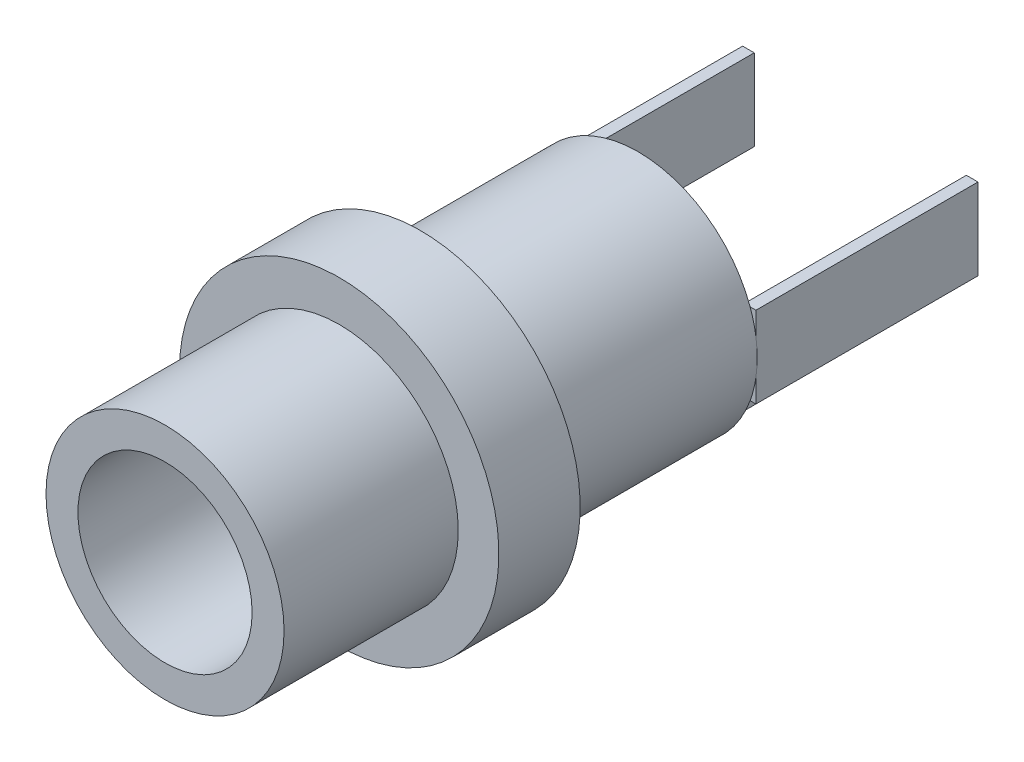
ISO-10303-21;
HEADER;
FILE_DESCRIPTION(('STEP AP214'),'2;1');
FILE_NAME('part.step','',(''),(''),'','','');
FILE_SCHEMA(('AUTOMOTIVE_DESIGN { 1 0 10303 214 1 1 1 1 }'));
ENDSEC;
DATA;
#1=APPLICATION_CONTEXT('core data for automotive mechanical design processes');
#2=APPLICATION_PROTOCOL_DEFINITION('international standard','automotive_design',2000,#1);
#3=PRODUCT_CONTEXT('',#1,'mechanical');
#4=PRODUCT('Part','Part','',(#3));
#5=PRODUCT_RELATED_PRODUCT_CATEGORY('part','',(#4));
#6=PRODUCT_DEFINITION_FORMATION('','',#4);
#7=PRODUCT_DEFINITION_CONTEXT('part definition',#1,'design');
#8=PRODUCT_DEFINITION('design','',#6,#7);
#9=PRODUCT_DEFINITION_SHAPE('','',#8);
#10=(LENGTH_UNIT() NAMED_UNIT(*) SI_UNIT(.MILLI.,.METRE.));
#11=(NAMED_UNIT(*) PLANE_ANGLE_UNIT() SI_UNIT($,.RADIAN.));
#12=(NAMED_UNIT(*) SI_UNIT($,.STERADIAN.) SOLID_ANGLE_UNIT());
#13=UNCERTAINTY_MEASURE_WITH_UNIT(LENGTH_MEASURE(1.E-05),#10,'distance_accuracy_value','');
#14=(GEOMETRIC_REPRESENTATION_CONTEXT(3) GLOBAL_UNCERTAINTY_ASSIGNED_CONTEXT((#13)) GLOBAL_UNIT_ASSIGNED_CONTEXT((#10,
#11,#12)) REPRESENTATION_CONTEXT('',''));
#15=CARTESIAN_POINT('',(0.,0.,0.));
#16=DIRECTION('',(0.,0.,1.));
#17=DIRECTION('',(1.,0.,0.));
#18=AXIS2_PLACEMENT_3D('',#15,#16,#17);
#19=CARTESIAN_POINT('',(0.,0.,-16.3));
#20=DIRECTION('',(0.,0.,-1.));
#21=DIRECTION('',(-1.,0.,0.));
#22=AXIS2_PLACEMENT_3D('',#19,#20,#21);
#23=PLANE('',#22);
#24=DIRECTION('',(0.,1.,0.));
#25=VECTOR('',#24,1.);
#26=CARTESIAN_POINT('',(-4.05356977359954,1.4,-16.3));
#27=LINE('',#26,#25);
#28=CARTESIAN_POINT('',(-4.05356977359954,0.615282122737358,-16.3));
#29=VERTEX_POINT('',#28);
#30=CARTESIAN_POINT('',(-4.05356977359954,-0.615282122737358,-16.3));
#31=VERTEX_POINT('',#30);
#32=EDGE_CURVE('E200',#29,#31,#27,.F.);
#33=ORIENTED_EDGE('',*,*,#32,.T.);
#34=CARTESIAN_POINT('',(0.,0.,-16.3));
#35=DIRECTION('',(0.,0.,-1.));
#36=DIRECTION('',(-1.,0.,0.));
#37=AXIS2_PLACEMENT_3D('',#34,#35,#36);
#38=CIRCLE('',#37,4.1);
#39=EDGE_CURVE('E617',#31,#29,#38,.T.);
#40=ORIENTED_EDGE('',*,*,#39,.T.);
#41=EDGE_LOOP('',(#33,#40));
#42=FACE_BOUND('',#41,.T.);
#43=ADVANCED_FACE('F34',(#42),#23,.T.);
#44=CARTESIAN_POINT('',(0.615282122737358,-4.05356977359954,-16.3));
#45=VERTEX_POINT('',#44);
#46=CARTESIAN_POINT('',(-0.615282122737358,-4.05356977359954,-16.3));
#47=VERTEX_POINT('',#46);
#48=EDGE_CURVE('E622',#45,#47,#38,.T.);
#49=ORIENTED_EDGE('',*,*,#48,.T.);
#50=DIRECTION('',(-1.,0.,0.));
#51=VECTOR('',#50,1.);
#52=CARTESIAN_POINT('',(1.4,-4.05356977359954,-16.3));
#53=LINE('',#52,#51);
#54=EDGE_CURVE('E224',#45,#47,#53,.T.);
#55=ORIENTED_EDGE('',*,*,#54,.F.);
#56=EDGE_LOOP('',(#49,#55));
#57=FACE_BOUND('',#56,.T.);
#58=ADVANCED_FACE('F321',(#57),#23,.T.);
#59=DIRECTION('',(1.,0.,0.));
#60=VECTOR('',#59,1.);
#61=CARTESIAN_POINT('',(-4.05356977359954,-1.4,-16.3));
#62=LINE('',#61,#60);
#63=CARTESIAN_POINT('',(-3.85356977359954,-1.4,-16.3));
#64=VERTEX_POINT('',#63);
#65=CARTESIAN_POINT('',(-3.65356977359954,-1.4,-16.3));
#66=VERTEX_POINT('',#65);
#67=EDGE_CURVE('E53',#64,#66,#62,.T.);
#68=ORIENTED_EDGE('',*,*,#67,.T.);
#69=DIRECTION('',(0.,1.,0.));
#70=VECTOR('',#69,1.);
#71=CARTESIAN_POINT('',(-3.65356977359954,1.4,-16.3));
#72=LINE('',#71,#70);
#73=CARTESIAN_POINT('',(-3.65356977359954,1.4,-16.3));
#74=VERTEX_POINT('',#73);
#75=EDGE_CURVE('E58',#74,#66,#72,.F.);
#76=ORIENTED_EDGE('',*,*,#75,.F.);
#77=DIRECTION('',(-1.,0.,0.));
#78=VECTOR('',#77,1.);
#79=CARTESIAN_POINT('',(-3.65356977359954,1.4,-16.3));
#80=LINE('',#79,#78);
#81=CARTESIAN_POINT('',(-3.85356977359954,1.4,-16.3));
#82=VERTEX_POINT('',#81);
#83=EDGE_CURVE('E174',#74,#82,#80,.T.);
#84=ORIENTED_EDGE('',*,*,#83,.T.);
#85=CARTESIAN_POINT('',(3.85356977359954,1.4,-16.3));
#86=VERTEX_POINT('',#85);
#87=EDGE_CURVE('E273',#82,#86,#38,.T.);
#88=ORIENTED_EDGE('',*,*,#87,.T.);
#89=DIRECTION('',(-1.,0.,0.));
#90=VECTOR('',#89,1.);
#91=CARTESIAN_POINT('',(4.05356977359954,1.4,-16.3));
#92=LINE('',#91,#90);
#93=CARTESIAN_POINT('',(3.65356977359954,1.4,-16.3));
#94=VERTEX_POINT('',#93);
#95=EDGE_CURVE('E43',#86,#94,#92,.T.);
#96=ORIENTED_EDGE('',*,*,#95,.T.);
#97=DIRECTION('',(0.,1.,0.));
#98=VECTOR('',#97,1.);
#99=CARTESIAN_POINT('',(3.65356977359954,1.4,-16.3));
#100=LINE('',#99,#98);
#101=CARTESIAN_POINT('',(3.65356977359954,-1.4,-16.3));
#102=VERTEX_POINT('',#101);
#103=EDGE_CURVE('E260',#94,#102,#100,.F.);
#104=ORIENTED_EDGE('',*,*,#103,.T.);
#105=DIRECTION('',(1.,0.,0.));
#106=VECTOR('',#105,1.);
#107=CARTESIAN_POINT('',(3.65356977359954,-1.4,-16.3));
#108=LINE('',#107,#106);
#109=CARTESIAN_POINT('',(3.85356977359954,-1.4,-16.3));
#110=VERTEX_POINT('',#109);
#111=EDGE_CURVE('E257',#102,#110,#108,.T.);
#112=ORIENTED_EDGE('',*,*,#111,.T.);
#113=CARTESIAN_POINT('',(1.4,-3.85356977359954,-16.3));
#114=VERTEX_POINT('',#113);
#115=EDGE_CURVE('E629',#110,#114,#38,.T.);
#116=ORIENTED_EDGE('',*,*,#115,.T.);
#117=DIRECTION('',(0.,1.,0.));
#118=VECTOR('',#117,1.);
#119=CARTESIAN_POINT('',(1.4,-4.05356977359954,-16.3));
#120=LINE('',#119,#118);
#121=CARTESIAN_POINT('',(1.4,-3.65356977359954,-16.3));
#122=VERTEX_POINT('',#121);
#123=EDGE_CURVE('E229',#114,#122,#120,.T.);
#124=ORIENTED_EDGE('',*,*,#123,.T.);
#125=DIRECTION('',(-1.,0.,0.));
#126=VECTOR('',#125,1.);
#127=CARTESIAN_POINT('',(1.4,-3.65356977359954,-16.3));
#128=LINE('',#127,#126);
#129=CARTESIAN_POINT('',(-1.4,-3.65356977359954,-16.3));
#130=VERTEX_POINT('',#129);
#131=EDGE_CURVE('E227',#122,#130,#128,.T.);
#132=ORIENTED_EDGE('',*,*,#131,.T.);
#133=DIRECTION('',(0.,-1.,0.));
#134=VECTOR('',#133,1.);
#135=CARTESIAN_POINT('',(-1.4,-3.65356977359954,-16.3));
#136=LINE('',#135,#134);
#137=CARTESIAN_POINT('',(-1.4,-3.85356977359954,-16.3));
#138=VERTEX_POINT('',#137);
#139=EDGE_CURVE('E225',#130,#138,#136,.T.);
#140=ORIENTED_EDGE('',*,*,#139,.T.);
#141=EDGE_CURVE('E618',#138,#64,#38,.T.);
#142=ORIENTED_EDGE('',*,*,#141,.T.);
#143=EDGE_LOOP('',(#68,#76,#84,#88,#96,#104,#112,#116,#124,#132,#140,#142));
#144=FACE_BOUND('',#143,.T.);
#145=ADVANCED_FACE('F328',(#144),#23,.T.);
#146=CARTESIAN_POINT('',(0.,0.,-6.));
#147=DIRECTION('',(0.,0.,1.));
#148=DIRECTION('',(1.,0.,0.));
#149=AXIS2_PLACEMENT_3D('',#146,#147,#148);
#150=CYLINDRICAL_SURFACE('',#149,4.1);
#151=CARTESIAN_POINT('',(0.,0.,-6.));
#152=DIRECTION('',(0.,0.,1.));
#153=DIRECTION('',(1.,0.,0.));
#154=AXIS2_PLACEMENT_3D('',#151,#152,#153);
#155=CIRCLE('',#154,4.1);
#156=CARTESIAN_POINT('',(4.1,0.,-6.));
#157=VERTEX_POINT('',#156);
#158=EDGE_CURVE('E284',#157,#157,#155,.T.);
#159=ORIENTED_EDGE('',*,*,#158,.T.);
#160=EDGE_LOOP('',(#159));
#161=FACE_BOUND('',#160,.T.);
#162=CARTESIAN_POINT('',(0.,0.,0.));
#163=DIRECTION('',(0.,0.,1.));
#164=DIRECTION('',(1.,0.,0.));
#165=AXIS2_PLACEMENT_3D('',#162,#163,#164);
#166=CIRCLE('',#165,4.1);
#167=CARTESIAN_POINT('',(4.1,0.,0.));
#168=VERTEX_POINT('',#167);
#169=EDGE_CURVE('E38',#168,#168,#166,.T.);
#170=ORIENTED_EDGE('',*,*,#169,.F.);
#171=EDGE_LOOP('',(#170));
#172=FACE_BOUND('',#171,.T.);
#173=ADVANCED_FACE('F36',(#161,#172),#150,.T.);
#174=CARTESIAN_POINT('',(0.,0.,0.));
#175=DIRECTION('',(0.,0.,1.));
#176=DIRECTION('',(1.,0.,0.));
#177=AXIS2_PLACEMENT_3D('',#174,#175,#176);
#178=PLANE('',#177);
#179=CARTESIAN_POINT('',(0.,0.,0.));
#180=DIRECTION('',(0.,0.,1.));
#181=DIRECTION('',(1.,0.,0.));
#182=AXIS2_PLACEMENT_3D('',#179,#180,#181);
#183=CIRCLE('',#182,3.);
#184=CARTESIAN_POINT('',(3.,0.,0.));
#185=VERTEX_POINT('',#184);
#186=EDGE_CURVE('E290',#185,#185,#183,.T.);
#187=ORIENTED_EDGE('',*,*,#186,.F.);
#188=EDGE_LOOP('',(#187));
#189=FACE_BOUND('',#188,.T.);
#190=ORIENTED_EDGE('',*,*,#169,.T.);
#191=EDGE_LOOP('',(#190));
#192=FACE_BOUND('',#191,.T.);
#193=ADVANCED_FACE('F349',(#189,#192),#178,.T.);
#194=CARTESIAN_POINT('',(0.,0.,-6.));
#195=DIRECTION('',(0.,0.,1.));
#196=DIRECTION('',(1.,0.,0.));
#197=AXIS2_PLACEMENT_3D('',#194,#195,#196);
#198=CYLINDRICAL_SURFACE('',#197,3.);
#199=CARTESIAN_POINT('',(0.,0.,-6.));
#200=DIRECTION('',(0.,0.,1.));
#201=DIRECTION('',(1.,0.,0.));
#202=AXIS2_PLACEMENT_3D('',#199,#200,#201);
#203=CIRCLE('',#202,3.);
#204=CARTESIAN_POINT('',(3.,0.,-6.));
#205=VERTEX_POINT('',#204);
#206=EDGE_CURVE('E287',#205,#205,#203,.T.);
#207=ORIENTED_EDGE('',*,*,#206,.F.);
#208=EDGE_LOOP('',(#207));
#209=FACE_BOUND('',#208,.T.);
#210=ORIENTED_EDGE('',*,*,#186,.T.);
#211=EDGE_LOOP('',(#210));
#212=FACE_BOUND('',#211,.T.);
#213=ADVANCED_FACE('F301',(#209,#212),#198,.F.);
#214=CARTESIAN_POINT('',(0.,0.,-6.));
#215=DIRECTION('',(0.,0.,-1.));
#216=DIRECTION('',(-1.,0.,0.));
#217=AXIS2_PLACEMENT_3D('',#214,#215,#216);
#218=PLANE('',#217);
#219=ORIENTED_EDGE('',*,*,#158,.F.);
#220=EDGE_LOOP('',(#219));
#221=FACE_BOUND('',#220,.T.);
#222=CARTESIAN_POINT('',(0.,0.,-6.));
#223=DIRECTION('',(0.,0.,-1.));
#224=DIRECTION('',(-1.,0.,0.));
#225=AXIS2_PLACEMENT_3D('',#222,#223,#224);
#226=CIRCLE('',#225,5.5);
#227=CARTESIAN_POINT('',(-5.5,0.,-6.));
#228=VERTEX_POINT('',#227);
#229=EDGE_CURVE('E276',#228,#228,#226,.T.);
#230=ORIENTED_EDGE('',*,*,#229,.F.);
#231=EDGE_LOOP('',(#230));
#232=FACE_BOUND('',#231,.T.);
#233=ADVANCED_FACE('F297',(#221,#232),#218,.F.);
#234=CARTESIAN_POINT('',(0.,0.,-8.8));
#235=DIRECTION('',(0.,0.,-1.));
#236=DIRECTION('',(-1.,0.,0.));
#237=AXIS2_PLACEMENT_3D('',#234,#235,#236);
#238=PLANE('',#237);
#239=CARTESIAN_POINT('',(0.,0.,-8.8));
#240=DIRECTION('',(0.,0.,-1.));
#241=DIRECTION('',(-1.,0.,0.));
#242=AXIS2_PLACEMENT_3D('',#239,#240,#241);
#243=CIRCLE('',#242,4.1);
#244=CARTESIAN_POINT('',(-4.1,0.,-8.8));
#245=VERTEX_POINT('',#244);
#246=EDGE_CURVE('E278',#245,#245,#243,.T.);
#247=ORIENTED_EDGE('',*,*,#246,.F.);
#248=EDGE_LOOP('',(#247));
#249=FACE_BOUND('',#248,.T.);
#250=CARTESIAN_POINT('',(0.,0.,-8.8));
#251=DIRECTION('',(0.,0.,-1.));
#252=DIRECTION('',(-1.,0.,0.));
#253=AXIS2_PLACEMENT_3D('',#250,#251,#252);
#254=CIRCLE('',#253,5.5);
#255=CARTESIAN_POINT('',(-5.5,0.,-8.8));
#256=VERTEX_POINT('',#255);
#257=EDGE_CURVE('E281',#256,#256,#254,.T.);
#258=ORIENTED_EDGE('',*,*,#257,.T.);
#259=EDGE_LOOP('',(#258));
#260=FACE_BOUND('',#259,.T.);
#261=ADVANCED_FACE('F300',(#249,#260),#238,.T.);
#262=CARTESIAN_POINT('',(0.,0.,-8.8));
#263=DIRECTION('',(0.,0.,1.));
#264=DIRECTION('',(1.,0.,0.));
#265=AXIS2_PLACEMENT_3D('',#262,#263,#264);
#266=CYLINDRICAL_SURFACE('',#265,5.5);
#267=ORIENTED_EDGE('',*,*,#257,.F.);
#268=EDGE_LOOP('',(#267));
#269=FACE_BOUND('',#268,.T.);
#270=ORIENTED_EDGE('',*,*,#229,.T.);
#271=EDGE_LOOP('',(#270));
#272=FACE_BOUND('',#271,.T.);
#273=ADVANCED_FACE('F306',(#269,#272),#266,.T.);
#274=ORIENTED_EDGE('',*,*,#206,.T.);
#275=EDGE_LOOP('',(#274));
#276=FACE_BOUND('',#275,.T.);
#277=ADVANCED_FACE('F303',(#276),#218,.F.);
#278=CARTESIAN_POINT('',(0.,0.,-16.3));
#279=DIRECTION('',(0.,0.,1.));
#280=DIRECTION('',(1.,0.,0.));
#281=AXIS2_PLACEMENT_3D('',#278,#279,#280);
#282=CYLINDRICAL_SURFACE('',#281,4.1);
#283=CARTESIAN_POINT('',(4.05356977359954,0.615282122737358,-16.3));
#284=VERTEX_POINT('',#283);
#285=EDGE_CURVE('E274',#86,#284,#38,.T.);
#286=ORIENTED_EDGE('',*,*,#285,.F.);
#287=ORIENTED_EDGE('',*,*,#87,.F.);
#288=EDGE_CURVE('E614',#29,#82,#38,.T.);
#289=ORIENTED_EDGE('',*,*,#288,.F.);
#290=ORIENTED_EDGE('',*,*,#39,.F.);
#291=EDGE_CURVE('E602',#64,#31,#38,.T.);
#292=ORIENTED_EDGE('',*,*,#291,.F.);
#293=ORIENTED_EDGE('',*,*,#141,.F.);
#294=EDGE_CURVE('E619',#47,#138,#38,.T.);
#295=ORIENTED_EDGE('',*,*,#294,.F.);
#296=ORIENTED_EDGE('',*,*,#48,.F.);
#297=EDGE_CURVE('E626',#114,#45,#38,.T.);
#298=ORIENTED_EDGE('',*,*,#297,.F.);
#299=ORIENTED_EDGE('',*,*,#115,.F.);
#300=CARTESIAN_POINT('',(4.05356977359954,-0.615282122737358,-16.3));
#301=VERTEX_POINT('',#300);
#302=EDGE_CURVE('E632',#301,#110,#38,.T.);
#303=ORIENTED_EDGE('',*,*,#302,.F.);
#304=EDGE_CURVE('E277',#284,#301,#38,.T.);
#305=ORIENTED_EDGE('',*,*,#304,.F.);
#306=EDGE_LOOP('',(#286,#287,#289,#290,#292,#293,#295,#296,#298,#299,#303,#305));
#307=FACE_BOUND('',#306,.T.);
#308=ORIENTED_EDGE('',*,*,#246,.T.);
#309=EDGE_LOOP('',(#308));
#310=FACE_BOUND('',#309,.T.);
#311=ADVANCED_FACE('F314',(#307,#310),#282,.T.);
#312=DIRECTION('',(0.,1.,0.));
#313=VECTOR('',#312,1.);
#314=CARTESIAN_POINT('',(4.05356977359954,1.4,-16.3));
#315=LINE('',#314,#313);
#316=EDGE_CURVE('E11',#284,#301,#315,.F.);
#317=ORIENTED_EDGE('',*,*,#316,.F.);
#318=ORIENTED_EDGE('',*,*,#304,.T.);
#319=EDGE_LOOP('',(#317,#318));
#320=FACE_BOUND('',#319,.T.);
#321=ADVANCED_FACE('F324',(#320),#23,.T.);
#322=CARTESIAN_POINT('',(0.,0.,-16.3));
#323=DIRECTION('',(0.,0.,-1.));
#324=DIRECTION('',(-1.,0.,0.));
#325=AXIS2_PLACEMENT_3D('',#322,#323,#324);
#326=PLANE('',#325);
#327=CARTESIAN_POINT('',(4.05356977359954,1.4,-16.3));
#328=VERTEX_POINT('',#327);
#329=EDGE_CURVE('E245',#328,#86,#92,.T.);
#330=ORIENTED_EDGE('',*,*,#329,.T.);
#331=ORIENTED_EDGE('',*,*,#285,.T.);
#332=EDGE_CURVE('E45',#328,#284,#315,.F.);
#333=ORIENTED_EDGE('',*,*,#332,.F.);
#334=EDGE_LOOP('',(#330,#331,#333));
#335=FACE_BOUND('',#334,.T.);
#336=ADVANCED_FACE('F334',(#335),#326,.F.);
#337=CARTESIAN_POINT('',(4.05356977359954,-1.4,-16.3));
#338=VERTEX_POINT('',#337);
#339=EDGE_CURVE('E46',#301,#338,#315,.F.);
#340=ORIENTED_EDGE('',*,*,#339,.F.);
#341=ORIENTED_EDGE('',*,*,#302,.T.);
#342=EDGE_CURVE('E256',#110,#338,#108,.T.);
#343=ORIENTED_EDGE('',*,*,#342,.T.);
#344=EDGE_LOOP('',(#340,#341,#343));
#345=FACE_BOUND('',#344,.T.);
#346=ADVANCED_FACE('F340',(#345),#326,.F.);
#347=CARTESIAN_POINT('',(4.05356977359954,1.4,-23.95));
#348=DIRECTION('',(-1.,0.,0.));
#349=DIRECTION('',(0.,0.,1.));
#350=AXIS2_PLACEMENT_3D('',#347,#348,#349);
#351=PLANE('',#350);
#352=ORIENTED_EDGE('',*,*,#332,.T.);
#353=ORIENTED_EDGE('',*,*,#316,.T.);
#354=ORIENTED_EDGE('',*,*,#339,.T.);
#355=DIRECTION('',(0.,0.,1.));
#356=VECTOR('',#355,1.);
#357=CARTESIAN_POINT('',(4.05356977359954,-1.4,-23.95));
#358=LINE('',#357,#356);
#359=CARTESIAN_POINT('',(4.05356977359954,-1.4,-23.95));
#360=VERTEX_POINT('',#359);
#361=EDGE_CURVE('E270',#360,#338,#358,.T.);
#362=ORIENTED_EDGE('',*,*,#361,.F.);
#363=DIRECTION('',(0.,1.,0.));
#364=VECTOR('',#363,1.);
#365=CARTESIAN_POINT('',(4.05356977359954,1.4,-23.95));
#366=LINE('',#365,#364);
#367=CARTESIAN_POINT('',(4.05356977359954,1.4,-23.95));
#368=VERTEX_POINT('',#367);
#369=EDGE_CURVE('E242',#368,#360,#366,.F.);
#370=ORIENTED_EDGE('',*,*,#369,.F.);
#371=DIRECTION('',(0.,0.,1.));
#372=VECTOR('',#371,1.);
#373=CARTESIAN_POINT('',(4.05356977359954,1.4,-23.95));
#374=LINE('',#373,#372);
#375=EDGE_CURVE('E253',#368,#328,#374,.T.);
#376=ORIENTED_EDGE('',*,*,#375,.T.);
#377=EDGE_LOOP('',(#352,#353,#354,#362,#370,#376));
#378=FACE_BOUND('',#377,.T.);
#379=ADVANCED_FACE('F417',(#378),#351,.F.);
#380=CARTESIAN_POINT('',(3.65356977359954,-1.4,-23.95));
#381=DIRECTION('',(0.,-1.,0.));
#382=DIRECTION('',(0.,0.,-1.));
#383=AXIS2_PLACEMENT_3D('',#380,#381,#382);
#384=PLANE('',#383);
#385=ORIENTED_EDGE('',*,*,#111,.F.);
#386=DIRECTION('',(0.,0.,1.));
#387=VECTOR('',#386,1.);
#388=CARTESIAN_POINT('',(3.65356977359954,-1.4,-23.95));
#389=LINE('',#388,#387);
#390=CARTESIAN_POINT('',(3.65356977359954,-1.4,-23.95));
#391=VERTEX_POINT('',#390);
#392=EDGE_CURVE('E268',#391,#102,#389,.T.);
#393=ORIENTED_EDGE('',*,*,#392,.F.);
#394=DIRECTION('',(1.,0.,0.));
#395=VECTOR('',#394,1.);
#396=CARTESIAN_POINT('',(3.65356977359954,-1.4,-23.95));
#397=LINE('',#396,#395);
#398=EDGE_CURVE('E244',#391,#360,#397,.T.);
#399=ORIENTED_EDGE('',*,*,#398,.T.);
#400=ORIENTED_EDGE('',*,*,#361,.T.);
#401=ORIENTED_EDGE('',*,*,#342,.F.);
#402=EDGE_LOOP('',(#385,#393,#399,#400,#401));
#403=FACE_BOUND('',#402,.T.);
#404=ADVANCED_FACE('F426',(#403),#384,.T.);
#405=CARTESIAN_POINT('',(3.65356977359954,1.4,-23.95));
#406=DIRECTION('',(-1.,0.,0.));
#407=DIRECTION('',(0.,0.,1.));
#408=AXIS2_PLACEMENT_3D('',#405,#406,#407);
#409=PLANE('',#408);
#410=ORIENTED_EDGE('',*,*,#103,.F.);
#411=DIRECTION('',(0.,0.,1.));
#412=VECTOR('',#411,1.);
#413=CARTESIAN_POINT('',(3.65356977359954,1.4,-23.95));
#414=LINE('',#413,#412);
#415=CARTESIAN_POINT('',(3.65356977359954,1.4,-23.95));
#416=VERTEX_POINT('',#415);
#417=EDGE_CURVE('E266',#416,#94,#414,.T.);
#418=ORIENTED_EDGE('',*,*,#417,.F.);
#419=DIRECTION('',(0.,1.,0.));
#420=VECTOR('',#419,1.);
#421=CARTESIAN_POINT('',(3.65356977359954,1.4,-23.95));
#422=LINE('',#421,#420);
#423=EDGE_CURVE('E248',#416,#391,#422,.F.);
#424=ORIENTED_EDGE('',*,*,#423,.T.);
#425=ORIENTED_EDGE('',*,*,#392,.T.);
#426=EDGE_LOOP('',(#410,#418,#424,#425));
#427=FACE_BOUND('',#426,.T.);
#428=ADVANCED_FACE('F435',(#427),#409,.T.);
#429=CARTESIAN_POINT('',(4.05356977359954,1.4,-23.95));
#430=DIRECTION('',(0.,1.,0.));
#431=DIRECTION('',(0.,0.,1.));
#432=AXIS2_PLACEMENT_3D('',#429,#430,#431);
#433=PLANE('',#432);
#434=ORIENTED_EDGE('',*,*,#329,.F.);
#435=ORIENTED_EDGE('',*,*,#375,.F.);
#436=DIRECTION('',(-1.,0.,0.));
#437=VECTOR('',#436,1.);
#438=CARTESIAN_POINT('',(4.05356977359954,1.4,-23.95));
#439=LINE('',#438,#437);
#440=EDGE_CURVE('E251',#368,#416,#439,.T.);
#441=ORIENTED_EDGE('',*,*,#440,.T.);
#442=ORIENTED_EDGE('',*,*,#417,.T.);
#443=ORIENTED_EDGE('',*,*,#95,.F.);
#444=EDGE_LOOP('',(#434,#435,#441,#442,#443));
#445=FACE_BOUND('',#444,.T.);
#446=ADVANCED_FACE('F445',(#445),#433,.T.);
#447=CARTESIAN_POINT('',(0.,0.,-23.95));
#448=DIRECTION('',(0.,0.,-1.));
#449=DIRECTION('',(-1.,0.,0.));
#450=AXIS2_PLACEMENT_3D('',#447,#448,#449);
#451=PLANE('',#450);
#452=ORIENTED_EDGE('',*,*,#369,.T.);
#453=ORIENTED_EDGE('',*,*,#398,.F.);
#454=ORIENTED_EDGE('',*,*,#423,.F.);
#455=ORIENTED_EDGE('',*,*,#440,.F.);
#456=EDGE_LOOP('',(#452,#453,#454,#455));
#457=FACE_BOUND('',#456,.T.);
#458=ADVANCED_FACE('F455',(#457),#451,.T.);
#459=CARTESIAN_POINT('',(0.,0.,-16.3));
#460=DIRECTION('',(0.,0.,1.));
#461=DIRECTION('',(1.,0.,0.));
#462=AXIS2_PLACEMENT_3D('',#459,#460,#461);
#463=PLANE('',#462);
#464=ORIENTED_EDGE('',*,*,#294,.T.);
#465=CARTESIAN_POINT('',(-1.4,-4.05356977359954,-16.3));
#466=VERTEX_POINT('',#465);
#467=EDGE_CURVE('E223',#138,#466,#136,.T.);
#468=ORIENTED_EDGE('',*,*,#467,.T.);
#469=EDGE_CURVE('E179',#47,#466,#53,.T.);
#470=ORIENTED_EDGE('',*,*,#469,.F.);
#471=EDGE_LOOP('',(#464,#468,#470));
#472=FACE_BOUND('',#471,.T.);
#473=ADVANCED_FACE('F465',(#472),#463,.T.);
#474=CARTESIAN_POINT('',(1.4,-4.05356977359954,-23.95));
#475=DIRECTION('',(0.,1.,0.));
#476=DIRECTION('',(0.,0.,1.));
#477=AXIS2_PLACEMENT_3D('',#474,#475,#476);
#478=PLANE('',#477);
#479=CARTESIAN_POINT('',(1.4,-4.05356977359954,-16.3));
#480=VERTEX_POINT('',#479);
#481=EDGE_CURVE('E220',#480,#45,#53,.T.);
#482=ORIENTED_EDGE('',*,*,#481,.T.);
#483=ORIENTED_EDGE('',*,*,#54,.T.);
#484=ORIENTED_EDGE('',*,*,#469,.T.);
#485=DIRECTION('',(0.,0.,1.));
#486=VECTOR('',#485,1.);
#487=CARTESIAN_POINT('',(-1.4,-4.05356977359954,-23.95));
#488=LINE('',#487,#486);
#489=CARTESIAN_POINT('',(-1.4,-4.05356977359954,-23.95));
#490=VERTEX_POINT('',#489);
#491=EDGE_CURVE('E239',#490,#466,#488,.T.);
#492=ORIENTED_EDGE('',*,*,#491,.F.);
#493=DIRECTION('',(-1.,0.,0.));
#494=VECTOR('',#493,1.);
#495=CARTESIAN_POINT('',(1.4,-4.05356977359954,-23.95));
#496=LINE('',#495,#494);
#497=CARTESIAN_POINT('',(1.4,-4.05356977359954,-23.95));
#498=VERTEX_POINT('',#497);
#499=EDGE_CURVE('E207',#498,#490,#496,.T.);
#500=ORIENTED_EDGE('',*,*,#499,.F.);
#501=DIRECTION('',(0.,0.,1.));
#502=VECTOR('',#501,1.);
#503=CARTESIAN_POINT('',(1.4,-4.05356977359954,-23.95));
#504=LINE('',#503,#502);
#505=EDGE_CURVE('E219',#498,#480,#504,.T.);
#506=ORIENTED_EDGE('',*,*,#505,.T.);
#507=EDGE_LOOP('',(#482,#483,#484,#492,#500,#506));
#508=FACE_BOUND('',#507,.T.);
#509=ADVANCED_FACE('F475',(#508),#478,.F.);
#510=CARTESIAN_POINT('',(-1.4,-3.65356977359954,-23.95));
#511=DIRECTION('',(-1.,0.,0.));
#512=DIRECTION('',(0.,0.,1.));
#513=AXIS2_PLACEMENT_3D('',#510,#511,#512);
#514=PLANE('',#513);
#515=ORIENTED_EDGE('',*,*,#139,.F.);
#516=DIRECTION('',(0.,0.,1.));
#517=VECTOR('',#516,1.);
#518=CARTESIAN_POINT('',(-1.4,-3.65356977359954,-23.95));
#519=LINE('',#518,#517);
#520=CARTESIAN_POINT('',(-1.4,-3.65356977359954,-23.95));
#521=VERTEX_POINT('',#520);
#522=EDGE_CURVE('E236',#521,#130,#519,.T.);
#523=ORIENTED_EDGE('',*,*,#522,.F.);
#524=DIRECTION('',(0.,-1.,0.));
#525=VECTOR('',#524,1.);
#526=CARTESIAN_POINT('',(-1.4,-3.65356977359954,-23.95));
#527=LINE('',#526,#525);
#528=EDGE_CURVE('E209',#521,#490,#527,.T.);
#529=ORIENTED_EDGE('',*,*,#528,.T.);
#530=ORIENTED_EDGE('',*,*,#491,.T.);
#531=ORIENTED_EDGE('',*,*,#467,.F.);
#532=EDGE_LOOP('',(#515,#523,#529,#530,#531));
#533=FACE_BOUND('',#532,.T.);
#534=ADVANCED_FACE('F486',(#533),#514,.T.);
#535=CARTESIAN_POINT('',(1.4,-3.65356977359954,-23.95));
#536=DIRECTION('',(0.,1.,0.));
#537=DIRECTION('',(0.,0.,1.));
#538=AXIS2_PLACEMENT_3D('',#535,#536,#537);
#539=PLANE('',#538);
#540=ORIENTED_EDGE('',*,*,#131,.F.);
#541=DIRECTION('',(0.,0.,1.));
#542=VECTOR('',#541,1.);
#543=CARTESIAN_POINT('',(1.4,-3.65356977359954,-23.95));
#544=LINE('',#543,#542);
#545=CARTESIAN_POINT('',(1.4,-3.65356977359954,-23.95));
#546=VERTEX_POINT('',#545);
#547=EDGE_CURVE('E233',#546,#122,#544,.T.);
#548=ORIENTED_EDGE('',*,*,#547,.F.);
#549=DIRECTION('',(-1.,0.,0.));
#550=VECTOR('',#549,1.);
#551=CARTESIAN_POINT('',(1.4,-3.65356977359954,-23.95));
#552=LINE('',#551,#550);
#553=EDGE_CURVE('E213',#546,#521,#552,.T.);
#554=ORIENTED_EDGE('',*,*,#553,.T.);
#555=ORIENTED_EDGE('',*,*,#522,.T.);
#556=EDGE_LOOP('',(#540,#548,#554,#555));
#557=FACE_BOUND('',#556,.T.);
#558=ADVANCED_FACE('F496',(#557),#539,.T.);
#559=CARTESIAN_POINT('',(1.4,-4.05356977359954,-23.95));
#560=DIRECTION('',(1.,0.,0.));
#561=DIRECTION('',(0.,0.,-1.));
#562=AXIS2_PLACEMENT_3D('',#559,#560,#561);
#563=PLANE('',#562);
#564=EDGE_CURVE('E210',#480,#114,#120,.T.);
#565=ORIENTED_EDGE('',*,*,#564,.F.);
#566=ORIENTED_EDGE('',*,*,#505,.F.);
#567=DIRECTION('',(0.,1.,0.));
#568=VECTOR('',#567,1.);
#569=CARTESIAN_POINT('',(1.4,-4.05356977359954,-23.95));
#570=LINE('',#569,#568);
#571=EDGE_CURVE('E216',#498,#546,#570,.T.);
#572=ORIENTED_EDGE('',*,*,#571,.T.);
#573=ORIENTED_EDGE('',*,*,#547,.T.);
#574=ORIENTED_EDGE('',*,*,#123,.F.);
#575=EDGE_LOOP('',(#565,#566,#572,#573,#574));
#576=FACE_BOUND('',#575,.T.);
#577=ADVANCED_FACE('F506',(#576),#563,.T.);
#578=CARTESIAN_POINT('',(0.,0.,-23.95));
#579=DIRECTION('',(0.,0.,1.));
#580=DIRECTION('',(1.,0.,0.));
#581=AXIS2_PLACEMENT_3D('',#578,#579,#580);
#582=PLANE('',#581);
#583=ORIENTED_EDGE('',*,*,#499,.T.);
#584=ORIENTED_EDGE('',*,*,#528,.F.);
#585=ORIENTED_EDGE('',*,*,#553,.F.);
#586=ORIENTED_EDGE('',*,*,#571,.F.);
#587=EDGE_LOOP('',(#583,#584,#585,#586));
#588=FACE_BOUND('',#587,.T.);
#589=ADVANCED_FACE('F516',(#588),#582,.F.);
#590=ORIENTED_EDGE('',*,*,#297,.T.);
#591=ORIENTED_EDGE('',*,*,#481,.F.);
#592=ORIENTED_EDGE('',*,*,#564,.T.);
#593=EDGE_LOOP('',(#590,#591,#592));
#594=FACE_BOUND('',#593,.T.);
#595=ADVANCED_FACE('F478',(#594),#463,.T.);
#596=CARTESIAN_POINT('',(0.,0.,-16.3));
#597=DIRECTION('',(0.,0.,-1.));
#598=DIRECTION('',(-1.,0.,0.));
#599=AXIS2_PLACEMENT_3D('',#596,#597,#598);
#600=PLANE('',#599);
#601=CARTESIAN_POINT('',(-4.05356977359954,1.4,-16.3));
#602=VERTEX_POINT('',#601);
#603=EDGE_CURVE('E196',#602,#29,#27,.F.);
#604=ORIENTED_EDGE('',*,*,#603,.T.);
#605=ORIENTED_EDGE('',*,*,#288,.T.);
#606=EDGE_CURVE('E199',#82,#602,#80,.T.);
#607=ORIENTED_EDGE('',*,*,#606,.T.);
#608=EDGE_LOOP('',(#604,#605,#607));
#609=FACE_BOUND('',#608,.T.);
#610=ADVANCED_FACE('F535',(#609),#600,.F.);
#611=CARTESIAN_POINT('',(-3.65356977359954,1.4,-23.95));
#612=DIRECTION('',(-1.,0.,0.));
#613=DIRECTION('',(0.,0.,1.));
#614=AXIS2_PLACEMENT_3D('',#611,#612,#613);
#615=PLANE('',#614);
#616=ORIENTED_EDGE('',*,*,#75,.T.);
#617=DIRECTION('',(0.,0.,1.));
#618=VECTOR('',#617,1.);
#619=CARTESIAN_POINT('',(-3.65356977359954,-1.4,-23.95));
#620=LINE('',#619,#618);
#621=CARTESIAN_POINT('',(-3.65356977359954,-1.4,-23.95));
#622=VERTEX_POINT('',#621);
#623=EDGE_CURVE('E176',#622,#66,#620,.T.);
#624=ORIENTED_EDGE('',*,*,#623,.F.);
#625=DIRECTION('',(0.,1.,0.));
#626=VECTOR('',#625,1.);
#627=CARTESIAN_POINT('',(-3.65356977359954,1.4,-23.95));
#628=LINE('',#627,#626);
#629=CARTESIAN_POINT('',(-3.65356977359954,1.4,-23.95));
#630=VERTEX_POINT('',#629);
#631=EDGE_CURVE('E164',#630,#622,#628,.F.);
#632=ORIENTED_EDGE('',*,*,#631,.F.);
#633=DIRECTION('',(0.,0.,1.));
#634=VECTOR('',#633,1.);
#635=CARTESIAN_POINT('',(-3.65356977359954,1.4,-23.95));
#636=LINE('',#635,#634);
#637=EDGE_CURVE('E190',#630,#74,#636,.T.);
#638=ORIENTED_EDGE('',*,*,#637,.T.);
#639=EDGE_LOOP('',(#616,#624,#632,#638));
#640=FACE_BOUND('',#639,.T.);
#641=ADVANCED_FACE('F177',(#640),#615,.F.);
#642=CARTESIAN_POINT('',(-4.05356977359954,-1.4,-23.95));
#643=DIRECTION('',(0.,-1.,0.));
#644=DIRECTION('',(0.,0.,-1.));
#645=AXIS2_PLACEMENT_3D('',#642,#643,#644);
#646=PLANE('',#645);
#647=CARTESIAN_POINT('',(-4.05356977359954,-1.4,-16.3));
#648=VERTEX_POINT('',#647);
#649=EDGE_CURVE('E192',#648,#64,#62,.T.);
#650=ORIENTED_EDGE('',*,*,#649,.F.);
#651=DIRECTION('',(0.,0.,1.));
#652=VECTOR('',#651,1.);
#653=CARTESIAN_POINT('',(-4.05356977359954,-1.4,-23.95));
#654=LINE('',#653,#652);
#655=CARTESIAN_POINT('',(-4.05356977359954,-1.4,-23.95));
#656=VERTEX_POINT('',#655);
#657=EDGE_CURVE('E180',#656,#648,#654,.T.);
#658=ORIENTED_EDGE('',*,*,#657,.F.);
#659=DIRECTION('',(1.,0.,0.));
#660=VECTOR('',#659,1.);
#661=CARTESIAN_POINT('',(-4.05356977359954,-1.4,-23.95));
#662=LINE('',#661,#660);
#663=EDGE_CURVE('E169',#656,#622,#662,.T.);
#664=ORIENTED_EDGE('',*,*,#663,.T.);
#665=ORIENTED_EDGE('',*,*,#623,.T.);
#666=ORIENTED_EDGE('',*,*,#67,.F.);
#667=EDGE_LOOP('',(#650,#658,#664,#665,#666));
#668=FACE_BOUND('',#667,.T.);
#669=ADVANCED_FACE('F183',(#668),#646,.T.);
#670=CARTESIAN_POINT('',(-4.05356977359954,1.4,-23.95));
#671=DIRECTION('',(-1.,0.,0.));
#672=DIRECTION('',(0.,0.,1.));
#673=AXIS2_PLACEMENT_3D('',#670,#671,#672);
#674=PLANE('',#673);
#675=ORIENTED_EDGE('',*,*,#603,.F.);
#676=DIRECTION('',(0.,0.,1.));
#677=VECTOR('',#676,1.);
#678=CARTESIAN_POINT('',(-4.05356977359954,1.4,-23.95));
#679=LINE('',#678,#677);
#680=CARTESIAN_POINT('',(-4.05356977359954,1.4,-23.95));
#681=VERTEX_POINT('',#680);
#682=EDGE_CURVE('E203',#681,#602,#679,.T.);
#683=ORIENTED_EDGE('',*,*,#682,.F.);
#684=DIRECTION('',(0.,1.,0.));
#685=VECTOR('',#684,1.);
#686=CARTESIAN_POINT('',(-4.05356977359954,1.4,-23.95));
#687=LINE('',#686,#685);
#688=EDGE_CURVE('E185',#681,#656,#687,.F.);
#689=ORIENTED_EDGE('',*,*,#688,.T.);
#690=ORIENTED_EDGE('',*,*,#657,.T.);
#691=EDGE_CURVE('E195',#31,#648,#27,.F.);
#692=ORIENTED_EDGE('',*,*,#691,.F.);
#693=ORIENTED_EDGE('',*,*,#32,.F.);
#694=EDGE_LOOP('',(#675,#683,#689,#690,#692,#693));
#695=FACE_BOUND('',#694,.T.);
#696=ADVANCED_FACE('F562',(#695),#674,.T.);
#697=CARTESIAN_POINT('',(-3.65356977359954,1.4,-23.95));
#698=DIRECTION('',(0.,1.,0.));
#699=DIRECTION('',(0.,0.,1.));
#700=AXIS2_PLACEMENT_3D('',#697,#698,#699);
#701=PLANE('',#700);
#702=ORIENTED_EDGE('',*,*,#83,.F.);
#703=ORIENTED_EDGE('',*,*,#637,.F.);
#704=DIRECTION('',(-1.,0.,0.));
#705=VECTOR('',#704,1.);
#706=CARTESIAN_POINT('',(-3.65356977359954,1.4,-23.95));
#707=LINE('',#706,#705);
#708=EDGE_CURVE('E172',#630,#681,#707,.T.);
#709=ORIENTED_EDGE('',*,*,#708,.T.);
#710=ORIENTED_EDGE('',*,*,#682,.T.);
#711=ORIENTED_EDGE('',*,*,#606,.F.);
#712=EDGE_LOOP('',(#702,#703,#709,#710,#711));
#713=FACE_BOUND('',#712,.T.);
#714=ADVANCED_FACE('F571',(#713),#701,.T.);
#715=CARTESIAN_POINT('',(0.,0.,-23.95));
#716=DIRECTION('',(0.,0.,-1.));
#717=DIRECTION('',(-1.,0.,0.));
#718=AXIS2_PLACEMENT_3D('',#715,#716,#717);
#719=PLANE('',#718);
#720=ORIENTED_EDGE('',*,*,#631,.T.);
#721=ORIENTED_EDGE('',*,*,#663,.F.);
#722=ORIENTED_EDGE('',*,*,#688,.F.);
#723=ORIENTED_EDGE('',*,*,#708,.F.);
#724=EDGE_LOOP('',(#720,#721,#722,#723));
#725=FACE_BOUND('',#724,.T.);
#726=ADVANCED_FACE('F166',(#725),#719,.T.);
#727=ORIENTED_EDGE('',*,*,#649,.T.);
#728=ORIENTED_EDGE('',*,*,#291,.T.);
#729=ORIENTED_EDGE('',*,*,#691,.T.);
#730=EDGE_LOOP('',(#727,#728,#729));
#731=FACE_BOUND('',#730,.T.);
#732=ADVANCED_FACE('F546',(#731),#600,.F.);
#733=CLOSED_SHELL('',(#43,#58,#145,#173,#193,#213,#233,#261,#273,#277,#311,#321,#336,#346,#379,
#404,#428,#446,#458,#473,#509,#534,#558,#577,#589,#595,#610,#641,#669,#696,#714,#726,#732));
#734=MANIFOLD_SOLID_BREP('B2',#733);
#735=ADVANCED_BREP_SHAPE_REPRESENTATION('',(#18,#734),#14);
#736=SHAPE_DEFINITION_REPRESENTATION(#9,#735);
ENDSEC;
END-ISO-10303-21;
